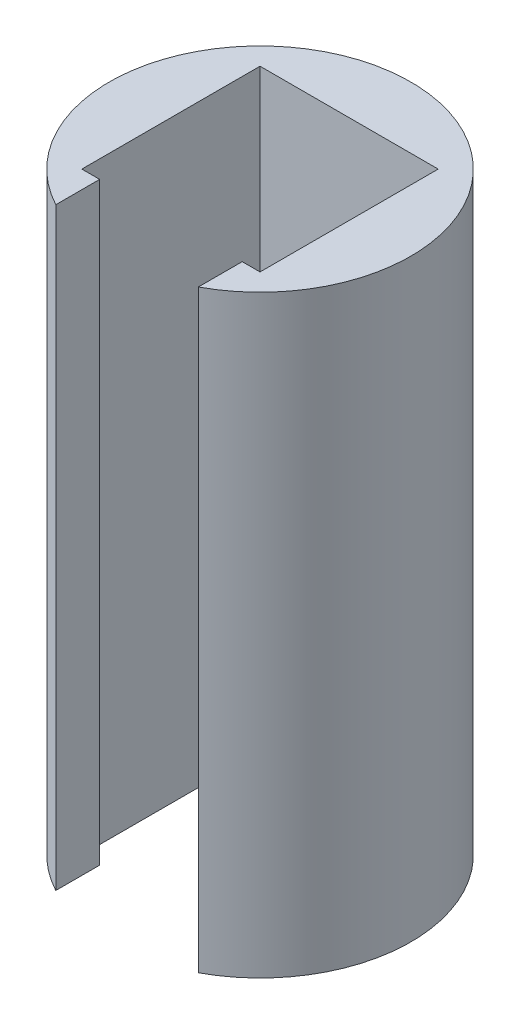
ISO-10303-21;
HEADER;
FILE_DESCRIPTION(('STEP AP214'),'2;1');
FILE_NAME('part.step','',(''),(''),'','','');
FILE_SCHEMA(('AUTOMOTIVE_DESIGN { 1 0 10303 214 1 1 1 1 }'));
ENDSEC;
DATA;
#1=APPLICATION_CONTEXT('core data for automotive mechanical design processes');
#2=APPLICATION_PROTOCOL_DEFINITION('international standard','automotive_design',2000,#1);
#3=PRODUCT_CONTEXT('',#1,'mechanical');
#4=PRODUCT('Part','Part','',(#3));
#5=PRODUCT_RELATED_PRODUCT_CATEGORY('part','',(#4));
#6=PRODUCT_DEFINITION_FORMATION('','',#4);
#7=PRODUCT_DEFINITION_CONTEXT('part definition',#1,'design');
#8=PRODUCT_DEFINITION('design','',#6,#7);
#9=PRODUCT_DEFINITION_SHAPE('','',#8);
#10=(LENGTH_UNIT() NAMED_UNIT(*) SI_UNIT(.MILLI.,.METRE.));
#11=(NAMED_UNIT(*) PLANE_ANGLE_UNIT() SI_UNIT($,.RADIAN.));
#12=(NAMED_UNIT(*) SI_UNIT($,.STERADIAN.) SOLID_ANGLE_UNIT());
#13=UNCERTAINTY_MEASURE_WITH_UNIT(LENGTH_MEASURE(1.E-05),#10,'distance_accuracy_value','');
#14=(GEOMETRIC_REPRESENTATION_CONTEXT(3) GLOBAL_UNCERTAINTY_ASSIGNED_CONTEXT((#13)) GLOBAL_UNIT_ASSIGNED_CONTEXT((#10,
#11,#12)) REPRESENTATION_CONTEXT('',''));
#15=CARTESIAN_POINT('',(0.,0.,0.));
#16=DIRECTION('',(0.,0.,1.));
#17=DIRECTION('',(1.,0.,0.));
#18=AXIS2_PLACEMENT_3D('',#15,#16,#17);
#19=CARTESIAN_POINT('',(7.5,50.,-7.5));
#20=DIRECTION('',(1.,0.,0.));
#21=DIRECTION('',(0.,0.,-1.));
#22=AXIS2_PLACEMENT_3D('',#19,#20,#21);
#23=PLANE('',#22);
#24=DIRECTION('',(0.,0.,1.));
#25=VECTOR('',#24,1.);
#26=CARTESIAN_POINT('',(7.5,0.,-7.5));
#27=LINE('',#26,#25);
#28=CARTESIAN_POINT('',(7.5,0.,-7.5));
#29=VERTEX_POINT('',#28);
#30=CARTESIAN_POINT('',(7.5,0.,7.5));
#31=VERTEX_POINT('',#30);
#32=EDGE_CURVE('E140',#29,#31,#27,.T.);
#33=ORIENTED_EDGE('',*,*,#32,.T.);
#34=DIRECTION('',(0.,-1.,0.));
#35=VECTOR('',#34,1.);
#36=CARTESIAN_POINT('',(7.5,50.,7.5));
#37=LINE('',#36,#35);
#38=CARTESIAN_POINT('',(7.5,50.,7.5));
#39=VERTEX_POINT('',#38);
#40=EDGE_CURVE('E11',#39,#31,#37,.T.);
#41=ORIENTED_EDGE('',*,*,#40,.F.);
#42=DIRECTION('',(0.,0.,1.));
#43=VECTOR('',#42,1.);
#44=CARTESIAN_POINT('',(7.5,50.,-7.5));
#45=LINE('',#44,#43);
#46=CARTESIAN_POINT('',(7.5,50.,-7.5));
#47=VERTEX_POINT('',#46);
#48=EDGE_CURVE('E162',#47,#39,#45,.T.);
#49=ORIENTED_EDGE('',*,*,#48,.F.);
#50=DIRECTION('',(0.,-1.,0.));
#51=VECTOR('',#50,1.);
#52=CARTESIAN_POINT('',(7.5,50.,-7.5));
#53=LINE('',#52,#51);
#54=EDGE_CURVE('E136',#47,#29,#53,.T.);
#55=ORIENTED_EDGE('',*,*,#54,.T.);
#56=EDGE_LOOP('',(#33,#41,#49,#55));
#57=FACE_BOUND('',#56,.T.);
#58=ADVANCED_FACE('F39',(#57),#23,.F.);
#59=CARTESIAN_POINT('',(5.99964317105099,50.,7.5));
#60=DIRECTION('',(0.,0.,1.));
#61=DIRECTION('',(1.,0.,0.));
#62=AXIS2_PLACEMENT_3D('',#59,#60,#61);
#63=PLANE('',#62);
#64=DIRECTION('',(-1.,0.,0.));
#65=VECTOR('',#64,1.);
#66=CARTESIAN_POINT('',(5.99964317105099,0.,7.5));
#67=LINE('',#66,#65);
#68=CARTESIAN_POINT('',(5.99964317105099,0.,7.5));
#69=VERTEX_POINT('',#68);
#70=EDGE_CURVE('E144',#31,#69,#67,.T.);
#71=ORIENTED_EDGE('',*,*,#70,.T.);
#72=DIRECTION('',(0.,-1.,0.));
#73=VECTOR('',#72,1.);
#74=CARTESIAN_POINT('',(5.99964317105099,50.,7.5));
#75=LINE('',#74,#73);
#76=CARTESIAN_POINT('',(5.99964317105099,50.,7.5));
#77=VERTEX_POINT('',#76);
#78=EDGE_CURVE('E48',#77,#69,#75,.T.);
#79=ORIENTED_EDGE('',*,*,#78,.F.);
#80=DIRECTION('',(-1.,0.,0.));
#81=VECTOR('',#80,1.);
#82=CARTESIAN_POINT('',(5.99964317105099,50.,7.5));
#83=LINE('',#82,#81);
#84=EDGE_CURVE('E99',#39,#77,#83,.T.);
#85=ORIENTED_EDGE('',*,*,#84,.F.);
#86=ORIENTED_EDGE('',*,*,#40,.T.);
#87=EDGE_LOOP('',(#71,#79,#85,#86));
#88=FACE_BOUND('',#87,.T.);
#89=ADVANCED_FACE('F208',(#88),#63,.F.);
#90=CARTESIAN_POINT('',(5.99964317105099,50.,11.1934928337879));
#91=DIRECTION('',(1.,0.,0.));
#92=DIRECTION('',(0.,0.,-1.));
#93=AXIS2_PLACEMENT_3D('',#90,#91,#92);
#94=PLANE('',#93);
#95=DIRECTION('',(0.,0.,1.));
#96=VECTOR('',#95,1.);
#97=CARTESIAN_POINT('',(5.99964317105099,0.,11.1934928337879));
#98=LINE('',#97,#96);
#99=CARTESIAN_POINT('',(5.99964317105099,0.,11.1934928337879));
#100=VERTEX_POINT('',#99);
#101=EDGE_CURVE('E147',#69,#100,#98,.T.);
#102=ORIENTED_EDGE('',*,*,#101,.T.);
#103=DIRECTION('',(0.,-1.,0.));
#104=VECTOR('',#103,1.);
#105=CARTESIAN_POINT('',(5.99964317105099,50.,11.1934928337879));
#106=LINE('',#105,#104);
#107=CARTESIAN_POINT('',(5.99964317105099,50.,11.1934928337879));
#108=VERTEX_POINT('',#107);
#109=EDGE_CURVE('E173',#108,#100,#106,.T.);
#110=ORIENTED_EDGE('',*,*,#109,.F.);
#111=DIRECTION('',(0.,0.,1.));
#112=VECTOR('',#111,1.);
#113=CARTESIAN_POINT('',(5.99964317105099,50.,11.1934928337879));
#114=LINE('',#113,#112);
#115=EDGE_CURVE('E183',#77,#108,#114,.T.);
#116=ORIENTED_EDGE('',*,*,#115,.F.);
#117=ORIENTED_EDGE('',*,*,#78,.T.);
#118=EDGE_LOOP('',(#102,#110,#116,#117));
#119=FACE_BOUND('',#118,.T.);
#120=ADVANCED_FACE('F181',(#119),#94,.F.);
#121=CARTESIAN_POINT('',(0.,50.,0.));
#122=DIRECTION('',(0.,-1.,0.));
#123=DIRECTION('',(0.,0.,-1.));
#124=AXIS2_PLACEMENT_3D('',#121,#122,#123);
#125=CYLINDRICAL_SURFACE('',#124,12.7);
#126=CARTESIAN_POINT('',(0.,0.,0.));
#127=DIRECTION('',(0.,1.,0.));
#128=DIRECTION('',(0.,0.,1.));
#129=AXIS2_PLACEMENT_3D('',#126,#127,#128);
#130=CIRCLE('',#129,12.7);
#131=CARTESIAN_POINT('',(-5.99964317105099,0.,11.1934928337879));
#132=VERTEX_POINT('',#131);
#133=EDGE_CURVE('E150',#100,#132,#130,.T.);
#134=ORIENTED_EDGE('',*,*,#133,.T.);
#135=DIRECTION('',(0.,-1.,0.));
#136=VECTOR('',#135,1.);
#137=CARTESIAN_POINT('',(-5.99964317105099,50.,11.1934928337879));
#138=LINE('',#137,#136);
#139=CARTESIAN_POINT('',(-5.99964317105099,50.,11.1934928337879));
#140=VERTEX_POINT('',#139);
#141=EDGE_CURVE('E169',#140,#132,#138,.T.);
#142=ORIENTED_EDGE('',*,*,#141,.F.);
#143=CARTESIAN_POINT('',(0.,50.,0.));
#144=DIRECTION('',(0.,1.,0.));
#145=DIRECTION('',(0.,0.,1.));
#146=AXIS2_PLACEMENT_3D('',#143,#144,#145);
#147=CIRCLE('',#146,12.7);
#148=EDGE_CURVE('E196',#108,#140,#147,.T.);
#149=ORIENTED_EDGE('',*,*,#148,.F.);
#150=ORIENTED_EDGE('',*,*,#109,.T.);
#151=EDGE_LOOP('',(#134,#142,#149,#150));
#152=FACE_BOUND('',#151,.T.);
#153=ADVANCED_FACE('F191',(#152),#125,.T.);
#154=CARTESIAN_POINT('',(-5.99964317105099,50.,7.5));
#155=DIRECTION('',(-1.,0.,0.));
#156=DIRECTION('',(0.,0.,1.));
#157=AXIS2_PLACEMENT_3D('',#154,#155,#156);
#158=PLANE('',#157);
#159=DIRECTION('',(0.,0.,-1.));
#160=VECTOR('',#159,1.);
#161=CARTESIAN_POINT('',(-5.99964317105099,0.,7.5));
#162=LINE('',#161,#160);
#163=CARTESIAN_POINT('',(-5.99964317105099,0.,7.5));
#164=VERTEX_POINT('',#163);
#165=EDGE_CURVE('E153',#132,#164,#162,.T.);
#166=ORIENTED_EDGE('',*,*,#165,.T.);
#167=DIRECTION('',(0.,-1.,0.));
#168=VECTOR('',#167,1.);
#169=CARTESIAN_POINT('',(-5.99964317105099,50.,7.5));
#170=LINE('',#169,#168);
#171=CARTESIAN_POINT('',(-5.99964317105099,50.,7.5));
#172=VERTEX_POINT('',#171);
#173=EDGE_CURVE('E129',#172,#164,#170,.T.);
#174=ORIENTED_EDGE('',*,*,#173,.F.);
#175=DIRECTION('',(0.,0.,-1.));
#176=VECTOR('',#175,1.);
#177=CARTESIAN_POINT('',(-5.99964317105099,50.,7.5));
#178=LINE('',#177,#176);
#179=EDGE_CURVE('E118',#140,#172,#178,.T.);
#180=ORIENTED_EDGE('',*,*,#179,.F.);
#181=ORIENTED_EDGE('',*,*,#141,.T.);
#182=EDGE_LOOP('',(#166,#174,#180,#181));
#183=FACE_BOUND('',#182,.T.);
#184=ADVANCED_FACE('F194',(#183),#158,.F.);
#185=CARTESIAN_POINT('',(-7.5,50.,7.5));
#186=DIRECTION('',(0.,0.,1.));
#187=DIRECTION('',(1.,0.,0.));
#188=AXIS2_PLACEMENT_3D('',#185,#186,#187);
#189=PLANE('',#188);
#190=DIRECTION('',(-1.,0.,0.));
#191=VECTOR('',#190,1.);
#192=CARTESIAN_POINT('',(-7.5,0.,7.5));
#193=LINE('',#192,#191);
#194=CARTESIAN_POINT('',(-7.5,0.,7.5));
#195=VERTEX_POINT('',#194);
#196=EDGE_CURVE('E127',#164,#195,#193,.T.);
#197=ORIENTED_EDGE('',*,*,#196,.T.);
#198=DIRECTION('',(0.,-1.,0.));
#199=VECTOR('',#198,1.);
#200=CARTESIAN_POINT('',(-7.5,50.,7.5));
#201=LINE('',#200,#199);
#202=CARTESIAN_POINT('',(-7.5,50.,7.5));
#203=VERTEX_POINT('',#202);
#204=EDGE_CURVE('E124',#203,#195,#201,.T.);
#205=ORIENTED_EDGE('',*,*,#204,.F.);
#206=DIRECTION('',(-1.,0.,0.));
#207=VECTOR('',#206,1.);
#208=CARTESIAN_POINT('',(-7.5,50.,7.5));
#209=LINE('',#208,#207);
#210=EDGE_CURVE('E112',#172,#203,#209,.T.);
#211=ORIENTED_EDGE('',*,*,#210,.F.);
#212=ORIENTED_EDGE('',*,*,#173,.T.);
#213=EDGE_LOOP('',(#197,#205,#211,#212));
#214=FACE_BOUND('',#213,.T.);
#215=ADVANCED_FACE('F125',(#214),#189,.F.);
#216=CARTESIAN_POINT('',(-7.5,50.,-7.5));
#217=DIRECTION('',(-1.,0.,0.));
#218=DIRECTION('',(0.,0.,1.));
#219=AXIS2_PLACEMENT_3D('',#216,#217,#218);
#220=PLANE('',#219);
#221=DIRECTION('',(0.,0.,-1.));
#222=VECTOR('',#221,1.);
#223=CARTESIAN_POINT('',(-7.5,0.,-7.5));
#224=LINE('',#223,#222);
#225=CARTESIAN_POINT('',(-7.5,0.,-7.5));
#226=VERTEX_POINT('',#225);
#227=EDGE_CURVE('E85',#195,#226,#224,.T.);
#228=ORIENTED_EDGE('',*,*,#227,.T.);
#229=DIRECTION('',(0.,-1.,0.));
#230=VECTOR('',#229,1.);
#231=CARTESIAN_POINT('',(-7.5,50.,-7.5));
#232=LINE('',#231,#230);
#233=CARTESIAN_POINT('',(-7.5,50.,-7.5));
#234=VERTEX_POINT('',#233);
#235=EDGE_CURVE('E130',#234,#226,#232,.T.);
#236=ORIENTED_EDGE('',*,*,#235,.F.);
#237=DIRECTION('',(0.,0.,-1.));
#238=VECTOR('',#237,1.);
#239=CARTESIAN_POINT('',(-7.5,50.,-7.5));
#240=LINE('',#239,#238);
#241=EDGE_CURVE('E116',#203,#234,#240,.T.);
#242=ORIENTED_EDGE('',*,*,#241,.F.);
#243=ORIENTED_EDGE('',*,*,#204,.T.);
#244=EDGE_LOOP('',(#228,#236,#242,#243));
#245=FACE_BOUND('',#244,.T.);
#246=ADVANCED_FACE('F132',(#245),#220,.F.);
#247=CARTESIAN_POINT('',(-7.5,50.,-7.5));
#248=DIRECTION('',(0.,0.,-1.));
#249=DIRECTION('',(-1.,0.,0.));
#250=AXIS2_PLACEMENT_3D('',#247,#248,#249);
#251=PLANE('',#250);
#252=DIRECTION('',(1.,0.,0.));
#253=VECTOR('',#252,1.);
#254=CARTESIAN_POINT('',(-7.5,0.,-7.5));
#255=LINE('',#254,#253);
#256=EDGE_CURVE('E91',#226,#29,#255,.T.);
#257=ORIENTED_EDGE('',*,*,#256,.T.);
#258=ORIENTED_EDGE('',*,*,#54,.F.);
#259=DIRECTION('',(1.,0.,0.));
#260=VECTOR('',#259,1.);
#261=CARTESIAN_POINT('',(-7.5,50.,-7.5));
#262=LINE('',#261,#260);
#263=EDGE_CURVE('E56',#234,#47,#262,.T.);
#264=ORIENTED_EDGE('',*,*,#263,.F.);
#265=ORIENTED_EDGE('',*,*,#235,.T.);
#266=EDGE_LOOP('',(#257,#258,#264,#265));
#267=FACE_BOUND('',#266,.T.);
#268=ADVANCED_FACE('F224',(#267),#251,.F.);
#269=CARTESIAN_POINT('',(0.,50.,0.));
#270=DIRECTION('',(0.,1.,0.));
#271=DIRECTION('',(0.,0.,1.));
#272=AXIS2_PLACEMENT_3D('',#269,#270,#271);
#273=PLANE('',#272);
#274=ORIENTED_EDGE('',*,*,#48,.T.);
#275=ORIENTED_EDGE('',*,*,#84,.T.);
#276=ORIENTED_EDGE('',*,*,#115,.T.);
#277=ORIENTED_EDGE('',*,*,#148,.T.);
#278=ORIENTED_EDGE('',*,*,#179,.T.);
#279=ORIENTED_EDGE('',*,*,#210,.T.);
#280=ORIENTED_EDGE('',*,*,#241,.T.);
#281=ORIENTED_EDGE('',*,*,#263,.T.);
#282=EDGE_LOOP('',(#274,#275,#276,#277,#278,#279,#280,#281));
#283=FACE_BOUND('',#282,.T.);
#284=ADVANCED_FACE('F114',(#283),#273,.T.);
#285=CARTESIAN_POINT('',(0.,0.,0.));
#286=DIRECTION('',(0.,1.,0.));
#287=DIRECTION('',(0.,0.,1.));
#288=AXIS2_PLACEMENT_3D('',#285,#286,#287);
#289=PLANE('',#288);
#290=ORIENTED_EDGE('',*,*,#32,.F.);
#291=ORIENTED_EDGE('',*,*,#256,.F.);
#292=ORIENTED_EDGE('',*,*,#227,.F.);
#293=ORIENTED_EDGE('',*,*,#196,.F.);
#294=ORIENTED_EDGE('',*,*,#165,.F.);
#295=ORIENTED_EDGE('',*,*,#133,.F.);
#296=ORIENTED_EDGE('',*,*,#101,.F.);
#297=ORIENTED_EDGE('',*,*,#70,.F.);
#298=EDGE_LOOP('',(#290,#291,#292,#293,#294,#295,#296,#297));
#299=FACE_BOUND('',#298,.T.);
#300=ADVANCED_FACE('F187',(#299),#289,.F.);
#301=CLOSED_SHELL('',(#58,#89,#120,#153,#184,#215,#246,#268,#284,#300));
#302=MANIFOLD_SOLID_BREP('B2',#301);
#303=ADVANCED_BREP_SHAPE_REPRESENTATION('',(#18,#302),#14);
#304=SHAPE_DEFINITION_REPRESENTATION(#9,#303);
ENDSEC;
END-ISO-10303-21;
